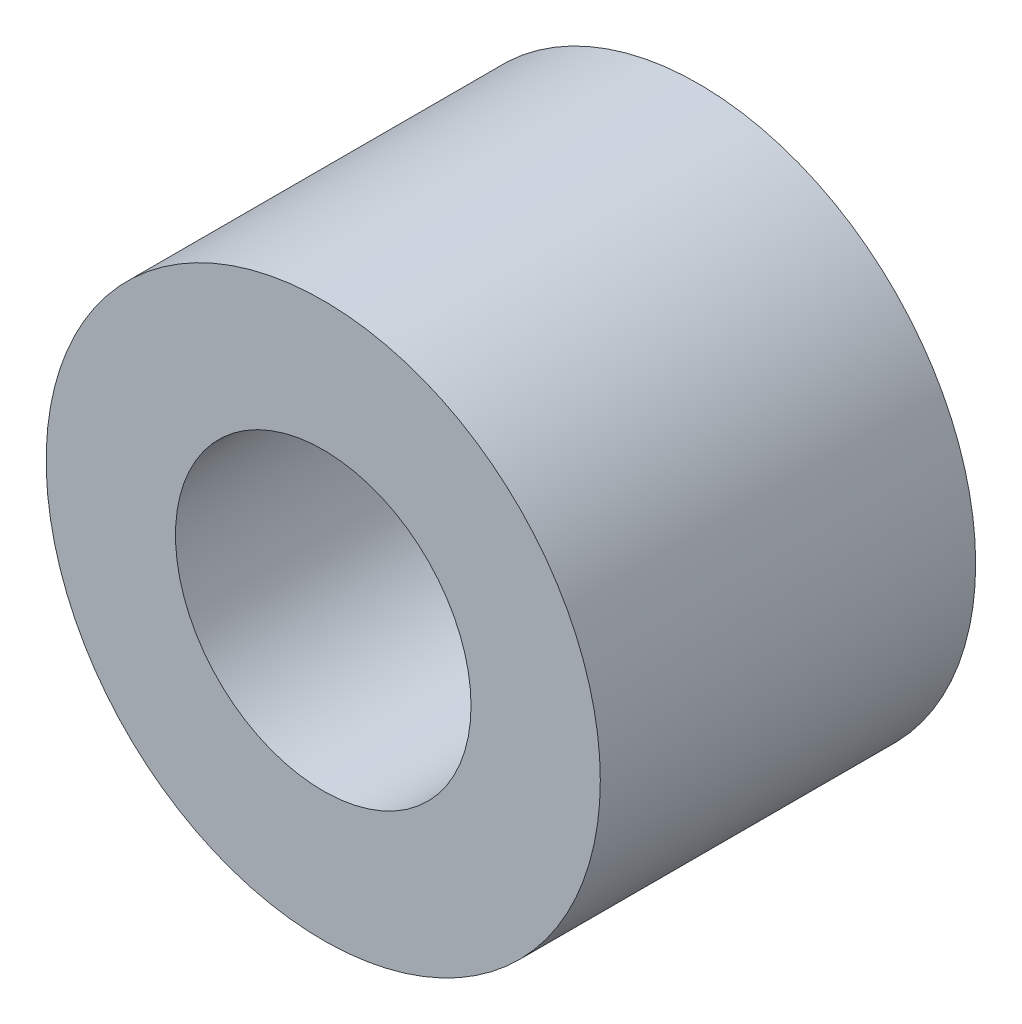
ISO-10303-21;
HEADER;
FILE_DESCRIPTION(('STEP AP214'),'2;1');
FILE_NAME('part.step','',(''),(''),'','','');
FILE_SCHEMA(('AUTOMOTIVE_DESIGN { 1 0 10303 214 1 1 1 1 }'));
ENDSEC;
DATA;
#1=APPLICATION_CONTEXT('core data for automotive mechanical design processes');
#2=APPLICATION_PROTOCOL_DEFINITION('international standard','automotive_design',2000,#1);
#3=PRODUCT_CONTEXT('',#1,'mechanical');
#4=PRODUCT('Part','Part','',(#3));
#5=PRODUCT_RELATED_PRODUCT_CATEGORY('part','',(#4));
#6=PRODUCT_DEFINITION_FORMATION('','',#4);
#7=PRODUCT_DEFINITION_CONTEXT('part definition',#1,'design');
#8=PRODUCT_DEFINITION('design','',#6,#7);
#9=PRODUCT_DEFINITION_SHAPE('','',#8);
#10=(LENGTH_UNIT() NAMED_UNIT(*) SI_UNIT(.MILLI.,.METRE.));
#11=(NAMED_UNIT(*) PLANE_ANGLE_UNIT() SI_UNIT($,.RADIAN.));
#12=(NAMED_UNIT(*) SI_UNIT($,.STERADIAN.) SOLID_ANGLE_UNIT());
#13=UNCERTAINTY_MEASURE_WITH_UNIT(LENGTH_MEASURE(1.E-05),#10,'distance_accuracy_value','');
#14=(GEOMETRIC_REPRESENTATION_CONTEXT(3) GLOBAL_UNCERTAINTY_ASSIGNED_CONTEXT((#13)) GLOBAL_UNIT_ASSIGNED_CONTEXT((#10,
#11,#12)) REPRESENTATION_CONTEXT('',''));
#15=CARTESIAN_POINT('',(0.,0.,0.));
#16=DIRECTION('',(0.,0.,1.));
#17=DIRECTION('',(1.,0.,0.));
#18=AXIS2_PLACEMENT_3D('',#15,#16,#17);
#19=CARTESIAN_POINT('',(0.,0.,5.08));
#20=DIRECTION('',(0.,0.,1.));
#21=DIRECTION('',(1.,0.,0.));
#22=AXIS2_PLACEMENT_3D('',#19,#20,#21);
#23=PLANE('',#22);
#24=CARTESIAN_POINT('',(0.,0.,5.08));
#25=DIRECTION('',(0.,0.,1.));
#26=DIRECTION('',(1.,0.,0.));
#27=AXIS2_PLACEMENT_3D('',#24,#25,#26);
#28=CIRCLE('',#27,3.75);
#29=CARTESIAN_POINT('',(3.75,0.,5.08));
#30=VERTEX_POINT('',#29);
#31=EDGE_CURVE('E10',#30,#30,#28,.T.);
#32=ORIENTED_EDGE('',*,*,#31,.T.);
#33=EDGE_LOOP('',(#32));
#34=FACE_BOUND('',#33,.T.);
#35=CARTESIAN_POINT('',(0.,0.,5.08));
#36=DIRECTION('',(0.,0.,1.));
#37=DIRECTION('',(1.,0.,0.));
#38=AXIS2_PLACEMENT_3D('',#35,#36,#37);
#39=CIRCLE('',#38,2.);
#40=CARTESIAN_POINT('',(2.,0.,5.08));
#41=VERTEX_POINT('',#40);
#42=EDGE_CURVE('E50',#41,#41,#39,.T.);
#43=ORIENTED_EDGE('',*,*,#42,.F.);
#44=EDGE_LOOP('',(#43));
#45=FACE_BOUND('',#44,.T.);
#46=ADVANCED_FACE('F39',(#34,#45),#23,.T.);
#47=CARTESIAN_POINT('',(0.,0.,0.));
#48=DIRECTION('',(0.,0.,1.));
#49=DIRECTION('',(1.,0.,0.));
#50=AXIS2_PLACEMENT_3D('',#47,#48,#49);
#51=PLANE('',#50);
#52=CARTESIAN_POINT('',(0.,0.,0.));
#53=DIRECTION('',(0.,0.,1.));
#54=DIRECTION('',(1.,0.,0.));
#55=AXIS2_PLACEMENT_3D('',#52,#53,#54);
#56=CIRCLE('',#55,3.75);
#57=CARTESIAN_POINT('',(3.75,0.,0.));
#58=VERTEX_POINT('',#57);
#59=EDGE_CURVE('E43',#58,#58,#56,.T.);
#60=ORIENTED_EDGE('',*,*,#59,.F.);
#61=EDGE_LOOP('',(#60));
#62=FACE_BOUND('',#61,.T.);
#63=CARTESIAN_POINT('',(0.,0.,0.));
#64=DIRECTION('',(0.,0.,1.));
#65=DIRECTION('',(1.,0.,0.));
#66=AXIS2_PLACEMENT_3D('',#63,#64,#65);
#67=CIRCLE('',#66,2.);
#68=CARTESIAN_POINT('',(2.,0.,0.));
#69=VERTEX_POINT('',#68);
#70=EDGE_CURVE('E52',#69,#69,#67,.T.);
#71=ORIENTED_EDGE('',*,*,#70,.T.);
#72=EDGE_LOOP('',(#71));
#73=FACE_BOUND('',#72,.T.);
#74=ADVANCED_FACE('F62',(#62,#73),#51,.F.);
#75=CARTESIAN_POINT('',(0.,0.,5.08));
#76=DIRECTION('',(0.,0.,-1.));
#77=DIRECTION('',(-1.,0.,0.));
#78=AXIS2_PLACEMENT_3D('',#75,#76,#77);
#79=CYLINDRICAL_SURFACE('',#78,3.75);
#80=ORIENTED_EDGE('',*,*,#31,.F.);
#81=EDGE_LOOP('',(#80));
#82=FACE_BOUND('',#81,.T.);
#83=ORIENTED_EDGE('',*,*,#59,.T.);
#84=EDGE_LOOP('',(#83));
#85=FACE_BOUND('',#84,.T.);
#86=ADVANCED_FACE('F41',(#82,#85),#79,.T.);
#87=CARTESIAN_POINT('',(0.,0.,5.08));
#88=DIRECTION('',(0.,0.,-1.));
#89=DIRECTION('',(-1.,0.,0.));
#90=AXIS2_PLACEMENT_3D('',#87,#88,#89);
#91=CYLINDRICAL_SURFACE('',#90,2.);
#92=ORIENTED_EDGE('',*,*,#42,.T.);
#93=EDGE_LOOP('',(#92));
#94=FACE_BOUND('',#93,.T.);
#95=ORIENTED_EDGE('',*,*,#70,.F.);
#96=EDGE_LOOP('',(#95));
#97=FACE_BOUND('',#96,.T.);
#98=ADVANCED_FACE('F58',(#94,#97),#91,.F.);
#99=CLOSED_SHELL('',(#46,#74,#86,#98));
#100=MANIFOLD_SOLID_BREP('B2',#99);
#101=ADVANCED_BREP_SHAPE_REPRESENTATION('',(#18,#100),#14);
#102=SHAPE_DEFINITION_REPRESENTATION(#9,#101);
ENDSEC;
END-ISO-10303-21;
